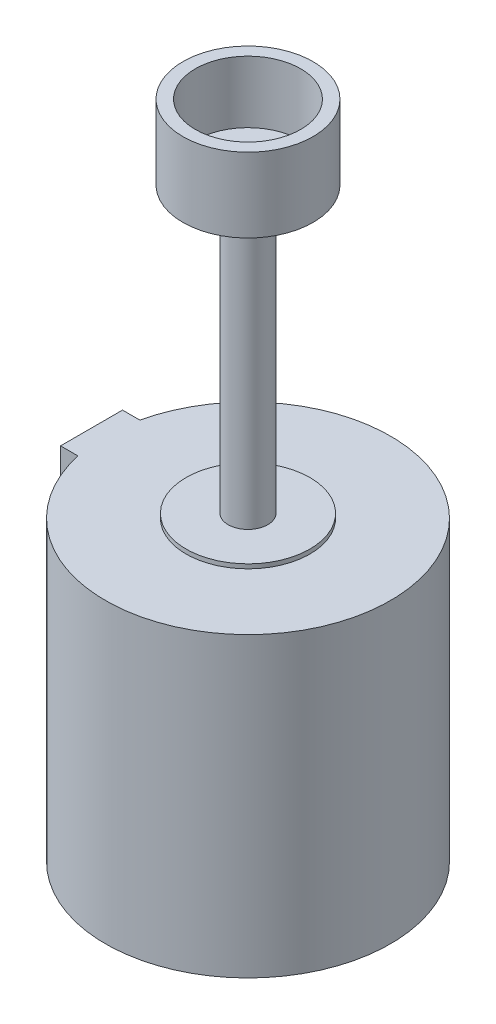
ISO-10303-21;
HEADER;
FILE_DESCRIPTION(('STEP AP214'),'2;1');
FILE_NAME('part.step','',(''),(''),'','','');
FILE_SCHEMA(('AUTOMOTIVE_DESIGN { 1 0 10303 214 1 1 1 1 }'));
ENDSEC;
DATA;
#1=APPLICATION_CONTEXT('core data for automotive mechanical design processes');
#2=APPLICATION_PROTOCOL_DEFINITION('international standard','automotive_design',2000,#1);
#3=PRODUCT_CONTEXT('',#1,'mechanical');
#4=PRODUCT('Part','Part','',(#3));
#5=PRODUCT_RELATED_PRODUCT_CATEGORY('part','',(#4));
#6=PRODUCT_DEFINITION_FORMATION('','',#4);
#7=PRODUCT_DEFINITION_CONTEXT('part definition',#1,'design');
#8=PRODUCT_DEFINITION('design','',#6,#7);
#9=PRODUCT_DEFINITION_SHAPE('','',#8);
#10=(LENGTH_UNIT() NAMED_UNIT(*) SI_UNIT(.MILLI.,.METRE.));
#11=(NAMED_UNIT(*) PLANE_ANGLE_UNIT() SI_UNIT($,.RADIAN.));
#12=(NAMED_UNIT(*) SI_UNIT($,.STERADIAN.) SOLID_ANGLE_UNIT());
#13=UNCERTAINTY_MEASURE_WITH_UNIT(LENGTH_MEASURE(1.E-05),#10,'distance_accuracy_value','');
#14=(GEOMETRIC_REPRESENTATION_CONTEXT(3) GLOBAL_UNCERTAINTY_ASSIGNED_CONTEXT((#13)) GLOBAL_UNIT_ASSIGNED_CONTEXT((#10,
#11,#12)) REPRESENTATION_CONTEXT('',''));
#15=CARTESIAN_POINT('',(0.,0.,0.));
#16=DIRECTION('',(0.,0.,1.));
#17=DIRECTION('',(1.,0.,0.));
#18=AXIS2_PLACEMENT_3D('',#15,#16,#17);
#19=CARTESIAN_POINT('',(0.,229.5,0.));
#20=DIRECTION('',(0.,-1.,0.));
#21=DIRECTION('',(0.,0.,-1.));
#22=AXIS2_PLACEMENT_3D('',#19,#20,#21);
#23=CYLINDRICAL_SURFACE('',#22,16.);
#24=CARTESIAN_POINT('',(0.,229.5,0.));
#25=DIRECTION('',(0.,1.,0.));
#26=DIRECTION('',(0.,0.,1.));
#27=AXIS2_PLACEMENT_3D('',#24,#25,#26);
#28=CIRCLE('',#27,16.);
#29=CARTESIAN_POINT('',(0.,229.5,16.));
#30=VERTEX_POINT('',#29);
#31=EDGE_CURVE('E11',#30,#30,#28,.T.);
#32=ORIENTED_EDGE('',*,*,#31,.F.);
#33=EDGE_LOOP('',(#32));
#34=FACE_BOUND('',#33,.T.);
#35=CARTESIAN_POINT('',(0.,0.,0.));
#36=DIRECTION('',(0.,1.,0.));
#37=DIRECTION('',(0.,0.,1.));
#38=AXIS2_PLACEMENT_3D('',#35,#36,#37);
#39=CIRCLE('',#38,16.);
#40=CARTESIAN_POINT('',(0.,0.,16.));
#41=VERTEX_POINT('',#40);
#42=EDGE_CURVE('E50',#41,#41,#39,.T.);
#43=ORIENTED_EDGE('',*,*,#42,.T.);
#44=EDGE_LOOP('',(#43));
#45=FACE_BOUND('',#44,.T.);
#46=ADVANCED_FACE('F47',(#34,#45),#23,.T.);
#47=CARTESIAN_POINT('',(0.,289.5,0.));
#48=DIRECTION('',(0.,-1.,0.));
#49=DIRECTION('',(0.,0.,-1.));
#50=AXIS2_PLACEMENT_3D('',#47,#48,#49);
#51=CYLINDRICAL_SURFACE('',#50,52.5);
#52=CARTESIAN_POINT('',(0.,289.5,0.));
#53=DIRECTION('',(0.,1.,0.));
#54=DIRECTION('',(0.,0.,1.));
#55=AXIS2_PLACEMENT_3D('',#52,#53,#54);
#56=CIRCLE('',#55,52.5);
#57=CARTESIAN_POINT('',(0.,289.5,52.5));
#58=VERTEX_POINT('',#57);
#59=EDGE_CURVE('E56',#58,#58,#56,.T.);
#60=ORIENTED_EDGE('',*,*,#59,.F.);
#61=EDGE_LOOP('',(#60));
#62=FACE_BOUND('',#61,.T.);
#63=CARTESIAN_POINT('',(0.,229.5,0.));
#64=DIRECTION('',(0.,1.,0.));
#65=DIRECTION('',(0.,0.,1.));
#66=AXIS2_PLACEMENT_3D('',#63,#64,#65);
#67=CIRCLE('',#66,52.5);
#68=CARTESIAN_POINT('',(0.,229.5,52.5));
#69=VERTEX_POINT('',#68);
#70=EDGE_CURVE('E134',#69,#69,#67,.T.);
#71=ORIENTED_EDGE('',*,*,#70,.T.);
#72=EDGE_LOOP('',(#71));
#73=FACE_BOUND('',#72,.T.);
#74=ADVANCED_FACE('F143',(#62,#73),#51,.T.);
#75=CARTESIAN_POINT('',(0.,289.5,0.));
#76=DIRECTION('',(0.,1.,0.));
#77=DIRECTION('',(0.,0.,1.));
#78=AXIS2_PLACEMENT_3D('',#75,#76,#77);
#79=PLANE('',#78);
#80=CARTESIAN_POINT('',(0.,289.5,0.));
#81=DIRECTION('',(0.,1.,0.));
#82=DIRECTION('',(0.,0.,1.));
#83=AXIS2_PLACEMENT_3D('',#80,#81,#82);
#84=CIRCLE('',#83,42.5);
#85=CARTESIAN_POINT('',(0.,289.5,42.5));
#86=VERTEX_POINT('',#85);
#87=EDGE_CURVE('E135',#86,#86,#84,.T.);
#88=ORIENTED_EDGE('',*,*,#87,.F.);
#89=EDGE_LOOP('',(#88));
#90=FACE_BOUND('',#89,.T.);
#91=ORIENTED_EDGE('',*,*,#59,.T.);
#92=EDGE_LOOP('',(#91));
#93=FACE_BOUND('',#92,.T.);
#94=ADVANCED_FACE('F148',(#90,#93),#79,.T.);
#95=CARTESIAN_POINT('',(0.,229.5,0.));
#96=DIRECTION('',(0.,1.,0.));
#97=DIRECTION('',(0.,0.,1.));
#98=AXIS2_PLACEMENT_3D('',#95,#96,#97);
#99=PLANE('',#98);
#100=ORIENTED_EDGE('',*,*,#31,.T.);
#101=EDGE_LOOP('',(#100));
#102=FACE_BOUND('',#101,.T.);
#103=ORIENTED_EDGE('',*,*,#70,.F.);
#104=EDGE_LOOP('',(#103));
#105=FACE_BOUND('',#104,.T.);
#106=ADVANCED_FACE('F145',(#102,#105),#99,.F.);
#107=CARTESIAN_POINT('',(0.,239.5,0.));
#108=DIRECTION('',(0.,1.,0.));
#109=DIRECTION('',(0.,0.,1.));
#110=AXIS2_PLACEMENT_3D('',#107,#108,#109);
#111=CYLINDRICAL_SURFACE('',#110,42.5);
#112=CARTESIAN_POINT('',(0.,239.5,0.));
#113=DIRECTION('',(0.,1.,0.));
#114=DIRECTION('',(0.,0.,1.));
#115=AXIS2_PLACEMENT_3D('',#112,#113,#114);
#116=CIRCLE('',#115,42.5);
#117=CARTESIAN_POINT('',(0.,239.5,42.5));
#118=VERTEX_POINT('',#117);
#119=EDGE_CURVE('E131',#118,#118,#116,.T.);
#120=ORIENTED_EDGE('',*,*,#119,.F.);
#121=EDGE_LOOP('',(#120));
#122=FACE_BOUND('',#121,.T.);
#123=ORIENTED_EDGE('',*,*,#87,.T.);
#124=EDGE_LOOP('',(#123));
#125=FACE_BOUND('',#124,.T.);
#126=ADVANCED_FACE('F147',(#122,#125),#111,.F.);
#127=CARTESIAN_POINT('',(0.,239.5,0.));
#128=DIRECTION('',(0.,1.,0.));
#129=DIRECTION('',(0.,0.,1.));
#130=AXIS2_PLACEMENT_3D('',#127,#128,#129);
#131=PLANE('',#130);
#132=ORIENTED_EDGE('',*,*,#119,.T.);
#133=EDGE_LOOP('',(#132));
#134=FACE_BOUND('',#133,.T.);
#135=ADVANCED_FACE('F156',(#134),#131,.T.);
#136=CARTESIAN_POINT('',(0.,-3.5,0.));
#137=DIRECTION('',(0.,1.,0.));
#138=DIRECTION('',(0.,0.,1.));
#139=AXIS2_PLACEMENT_3D('',#136,#137,#138);
#140=CYLINDRICAL_SURFACE('',#139,50.);
#141=CARTESIAN_POINT('',(0.,-3.5,0.));
#142=DIRECTION('',(0.,-1.,0.));
#143=DIRECTION('',(0.,0.,-1.));
#144=AXIS2_PLACEMENT_3D('',#141,#142,#143);
#145=CIRCLE('',#144,50.);
#146=CARTESIAN_POINT('',(0.,-3.5,-50.));
#147=VERTEX_POINT('',#146);
#148=EDGE_CURVE('E126',#147,#147,#145,.T.);
#149=ORIENTED_EDGE('',*,*,#148,.F.);
#150=EDGE_LOOP('',(#149));
#151=FACE_BOUND('',#150,.T.);
#152=CARTESIAN_POINT('',(0.,0.,0.));
#153=DIRECTION('',(0.,-1.,0.));
#154=DIRECTION('',(0.,0.,-1.));
#155=AXIS2_PLACEMENT_3D('',#152,#153,#154);
#156=CIRCLE('',#155,50.);
#157=CARTESIAN_POINT('',(0.,0.,-50.));
#158=VERTEX_POINT('',#157);
#159=EDGE_CURVE('E125',#158,#158,#156,.T.);
#160=ORIENTED_EDGE('',*,*,#159,.T.);
#161=EDGE_LOOP('',(#160));
#162=FACE_BOUND('',#161,.T.);
#163=ADVANCED_FACE('F175',(#151,#162),#140,.T.);
#164=CARTESIAN_POINT('',(0.,0.,0.));
#165=DIRECTION('',(0.,-1.,0.));
#166=DIRECTION('',(0.,0.,-1.));
#167=AXIS2_PLACEMENT_3D('',#164,#165,#166);
#168=PLANE('',#167);
#169=ORIENTED_EDGE('',*,*,#42,.F.);
#170=EDGE_LOOP('',(#169));
#171=FACE_BOUND('',#170,.T.);
#172=ORIENTED_EDGE('',*,*,#159,.F.);
#173=EDGE_LOOP('',(#172));
#174=FACE_BOUND('',#173,.T.);
#175=ADVANCED_FACE('F171',(#171,#174),#168,.F.);
#176=CARTESIAN_POINT('',(0.,-243.5,0.));
#177=DIRECTION('',(0.,1.,0.));
#178=DIRECTION('',(0.,0.,1.));
#179=AXIS2_PLACEMENT_3D('',#176,#177,#178);
#180=CYLINDRICAL_SURFACE('',#179,115.);
#181=CARTESIAN_POINT('',(0.,-3.5,0.));
#182=DIRECTION('',(0.,-1.,0.));
#183=DIRECTION('',(0.,0.,-1.));
#184=AXIS2_PLACEMENT_3D('',#181,#182,#183);
#185=CIRCLE('',#184,115.);
#186=CARTESIAN_POINT('',(-112.249721603218,-3.5,-25.));
#187=VERTEX_POINT('',#186);
#188=CARTESIAN_POINT('',(-112.249721603218,-3.5,25.));
#189=VERTEX_POINT('',#188);
#190=EDGE_CURVE('E115',#187,#189,#185,.T.);
#191=ORIENTED_EDGE('',*,*,#190,.T.);
#192=DIRECTION('',(0.,1.,0.));
#193=VECTOR('',#192,1.);
#194=CARTESIAN_POINT('',(-112.249721603218,-243.5,25.));
#195=LINE('',#194,#193);
#196=CARTESIAN_POINT('',(-112.249721603218,-243.5,25.));
#197=VERTEX_POINT('',#196);
#198=EDGE_CURVE('E106',#197,#189,#195,.T.);
#199=ORIENTED_EDGE('',*,*,#198,.F.);
#200=CARTESIAN_POINT('',(0.,-243.5,0.));
#201=DIRECTION('',(0.,-1.,0.));
#202=DIRECTION('',(0.,0.,-1.));
#203=AXIS2_PLACEMENT_3D('',#200,#201,#202);
#204=CIRCLE('',#203,115.);
#205=CARTESIAN_POINT('',(-112.249721603218,-243.5,-25.));
#206=VERTEX_POINT('',#205);
#207=EDGE_CURVE('E100',#206,#197,#204,.T.);
#208=ORIENTED_EDGE('',*,*,#207,.F.);
#209=DIRECTION('',(0.,1.,0.));
#210=VECTOR('',#209,1.);
#211=CARTESIAN_POINT('',(-112.249721603218,-243.5,-25.));
#212=LINE('',#211,#210);
#213=EDGE_CURVE('E111',#206,#187,#212,.T.);
#214=ORIENTED_EDGE('',*,*,#213,.T.);
#215=EDGE_LOOP('',(#191,#199,#208,#214));
#216=FACE_BOUND('',#215,.T.);
#217=ADVANCED_FACE('F174',(#216),#180,.T.);
#218=CARTESIAN_POINT('',(-112.249721603218,-243.5,25.));
#219=DIRECTION('',(0.,0.,-1.));
#220=DIRECTION('',(-1.,0.,0.));
#221=AXIS2_PLACEMENT_3D('',#218,#219,#220);
#222=PLANE('',#221);
#223=DIRECTION('',(-1.,0.,0.));
#224=VECTOR('',#223,1.);
#225=CARTESIAN_POINT('',(-112.249721603218,-3.5,25.));
#226=LINE('',#225,#224);
#227=CARTESIAN_POINT('',(-126.279721603218,-3.5,25.));
#228=VERTEX_POINT('',#227);
#229=EDGE_CURVE('E105',#189,#228,#226,.T.);
#230=ORIENTED_EDGE('',*,*,#229,.T.);
#231=DIRECTION('',(0.,1.,0.));
#232=VECTOR('',#231,1.);
#233=CARTESIAN_POINT('',(-126.279721603218,-243.5,25.));
#234=LINE('',#233,#232);
#235=CARTESIAN_POINT('',(-126.279721603218,-243.5,25.));
#236=VERTEX_POINT('',#235);
#237=EDGE_CURVE('E103',#236,#228,#234,.T.);
#238=ORIENTED_EDGE('',*,*,#237,.F.);
#239=DIRECTION('',(-1.,0.,0.));
#240=VECTOR('',#239,1.);
#241=CARTESIAN_POINT('',(-112.249721603218,-243.5,25.));
#242=LINE('',#241,#240);
#243=EDGE_CURVE('E95',#197,#236,#242,.T.);
#244=ORIENTED_EDGE('',*,*,#243,.F.);
#245=ORIENTED_EDGE('',*,*,#198,.T.);
#246=EDGE_LOOP('',(#230,#238,#244,#245));
#247=FACE_BOUND('',#246,.T.);
#248=ADVANCED_FACE('F104',(#247),#222,.F.);
#249=CARTESIAN_POINT('',(-126.279721603218,-243.5,25.));
#250=DIRECTION('',(1.,0.,0.));
#251=DIRECTION('',(0.,0.,-1.));
#252=AXIS2_PLACEMENT_3D('',#249,#250,#251);
#253=PLANE('',#252);
#254=DIRECTION('',(0.,0.,-1.));
#255=VECTOR('',#254,1.);
#256=CARTESIAN_POINT('',(-126.279721603218,-3.5,25.));
#257=LINE('',#256,#255);
#258=CARTESIAN_POINT('',(-126.279721603218,-3.5,-25.));
#259=VERTEX_POINT('',#258);
#260=EDGE_CURVE('E81',#228,#259,#257,.T.);
#261=ORIENTED_EDGE('',*,*,#260,.T.);
#262=DIRECTION('',(0.,1.,0.));
#263=VECTOR('',#262,1.);
#264=CARTESIAN_POINT('',(-126.279721603218,-243.5,-25.));
#265=LINE('',#264,#263);
#266=CARTESIAN_POINT('',(-126.279721603218,-243.5,-25.));
#267=VERTEX_POINT('',#266);
#268=EDGE_CURVE('E107',#267,#259,#265,.T.);
#269=ORIENTED_EDGE('',*,*,#268,.F.);
#270=DIRECTION('',(0.,0.,-1.));
#271=VECTOR('',#270,1.);
#272=CARTESIAN_POINT('',(-126.279721603218,-243.5,25.));
#273=LINE('',#272,#271);
#274=EDGE_CURVE('E98',#236,#267,#273,.T.);
#275=ORIENTED_EDGE('',*,*,#274,.F.);
#276=ORIENTED_EDGE('',*,*,#237,.T.);
#277=EDGE_LOOP('',(#261,#269,#275,#276));
#278=FACE_BOUND('',#277,.T.);
#279=ADVANCED_FACE('F109',(#278),#253,.F.);
#280=CARTESIAN_POINT('',(-126.279721603218,-243.5,-25.));
#281=DIRECTION('',(0.,0.,1.));
#282=DIRECTION('',(1.,0.,0.));
#283=AXIS2_PLACEMENT_3D('',#280,#281,#282);
#284=PLANE('',#283);
#285=DIRECTION('',(1.,0.,0.));
#286=VECTOR('',#285,1.);
#287=CARTESIAN_POINT('',(-126.279721603218,-3.5,-25.));
#288=LINE('',#287,#286);
#289=EDGE_CURVE('E87',#259,#187,#288,.T.);
#290=ORIENTED_EDGE('',*,*,#289,.T.);
#291=ORIENTED_EDGE('',*,*,#213,.F.);
#292=DIRECTION('',(1.,0.,0.));
#293=VECTOR('',#292,1.);
#294=CARTESIAN_POINT('',(-126.279721603218,-243.5,-25.));
#295=LINE('',#294,#293);
#296=EDGE_CURVE('E64',#267,#206,#295,.T.);
#297=ORIENTED_EDGE('',*,*,#296,.F.);
#298=ORIENTED_EDGE('',*,*,#268,.T.);
#299=EDGE_LOOP('',(#290,#291,#297,#298));
#300=FACE_BOUND('',#299,.T.);
#301=ADVANCED_FACE('F197',(#300),#284,.F.);
#302=CARTESIAN_POINT('',(0.,-243.5,0.));
#303=DIRECTION('',(0.,-1.,0.));
#304=DIRECTION('',(0.,0.,-1.));
#305=AXIS2_PLACEMENT_3D('',#302,#303,#304);
#306=PLANE('',#305);
#307=CARTESIAN_POINT('',(0.,-243.5,0.));
#308=DIRECTION('',(0.,-1.,0.));
#309=DIRECTION('',(0.,0.,-1.));
#310=AXIS2_PLACEMENT_3D('',#307,#308,#309);
#311=CIRCLE('',#310,110.);
#312=CARTESIAN_POINT('',(0.,-243.5,-110.));
#313=VERTEX_POINT('',#312);
#314=EDGE_CURVE('E219',#313,#313,#311,.T.);
#315=ORIENTED_EDGE('',*,*,#314,.F.);
#316=EDGE_LOOP('',(#315));
#317=FACE_BOUND('',#316,.T.);
#318=ORIENTED_EDGE('',*,*,#207,.T.);
#319=ORIENTED_EDGE('',*,*,#243,.T.);
#320=ORIENTED_EDGE('',*,*,#274,.T.);
#321=ORIENTED_EDGE('',*,*,#296,.T.);
#322=EDGE_LOOP('',(#318,#319,#320,#321));
#323=FACE_BOUND('',#322,.T.);
#324=ADVANCED_FACE('F96',(#317,#323),#306,.T.);
#325=CARTESIAN_POINT('',(0.,-3.5,0.));
#326=DIRECTION('',(0.,-1.,0.));
#327=DIRECTION('',(0.,0.,-1.));
#328=AXIS2_PLACEMENT_3D('',#325,#326,#327);
#329=PLANE('',#328);
#330=ORIENTED_EDGE('',*,*,#148,.T.);
#331=EDGE_LOOP('',(#330));
#332=FACE_BOUND('',#331,.T.);
#333=ORIENTED_EDGE('',*,*,#190,.F.);
#334=ORIENTED_EDGE('',*,*,#289,.F.);
#335=ORIENTED_EDGE('',*,*,#260,.F.);
#336=ORIENTED_EDGE('',*,*,#229,.F.);
#337=EDGE_LOOP('',(#333,#334,#335,#336));
#338=FACE_BOUND('',#337,.T.);
#339=ADVANCED_FACE('F200',(#332,#338),#329,.F.);
#340=CARTESIAN_POINT('',(0.,-193.5,0.));
#341=DIRECTION('',(0.,-1.,0.));
#342=DIRECTION('',(0.,0.,-1.));
#343=AXIS2_PLACEMENT_3D('',#340,#341,#342);
#344=CYLINDRICAL_SURFACE('',#343,110.);
#345=CARTESIAN_POINT('',(0.,-193.5,0.));
#346=DIRECTION('',(0.,-1.,0.));
#347=DIRECTION('',(0.,0.,-1.));
#348=AXIS2_PLACEMENT_3D('',#345,#346,#347);
#349=CIRCLE('',#348,110.);
#350=CARTESIAN_POINT('',(0.,-193.5,-110.));
#351=VERTEX_POINT('',#350);
#352=EDGE_CURVE('E118',#351,#351,#349,.T.);
#353=ORIENTED_EDGE('',*,*,#352,.F.);
#354=EDGE_LOOP('',(#353));
#355=FACE_BOUND('',#354,.T.);
#356=ORIENTED_EDGE('',*,*,#314,.T.);
#357=EDGE_LOOP('',(#356));
#358=FACE_BOUND('',#357,.T.);
#359=ADVANCED_FACE('F203',(#355,#358),#344,.F.);
#360=CARTESIAN_POINT('',(0.,-193.5,0.));
#361=DIRECTION('',(0.,-1.,0.));
#362=DIRECTION('',(0.,0.,-1.));
#363=AXIS2_PLACEMENT_3D('',#360,#361,#362);
#364=PLANE('',#363);
#365=ORIENTED_EDGE('',*,*,#352,.T.);
#366=EDGE_LOOP('',(#365));
#367=FACE_BOUND('',#366,.T.);
#368=ADVANCED_FACE('F210',(#367),#364,.T.);
#369=CLOSED_SHELL('',(#46,#74,#94,#106,#126,#135,#163,#175,#217,#248,#279,#301,#324,#339,#359,#368));
#370=MANIFOLD_SOLID_BREP('B2',#369);
#371=ADVANCED_BREP_SHAPE_REPRESENTATION('',(#18,#370),#14);
#372=SHAPE_DEFINITION_REPRESENTATION(#9,#371);
ENDSEC;
END-ISO-10303-21;
